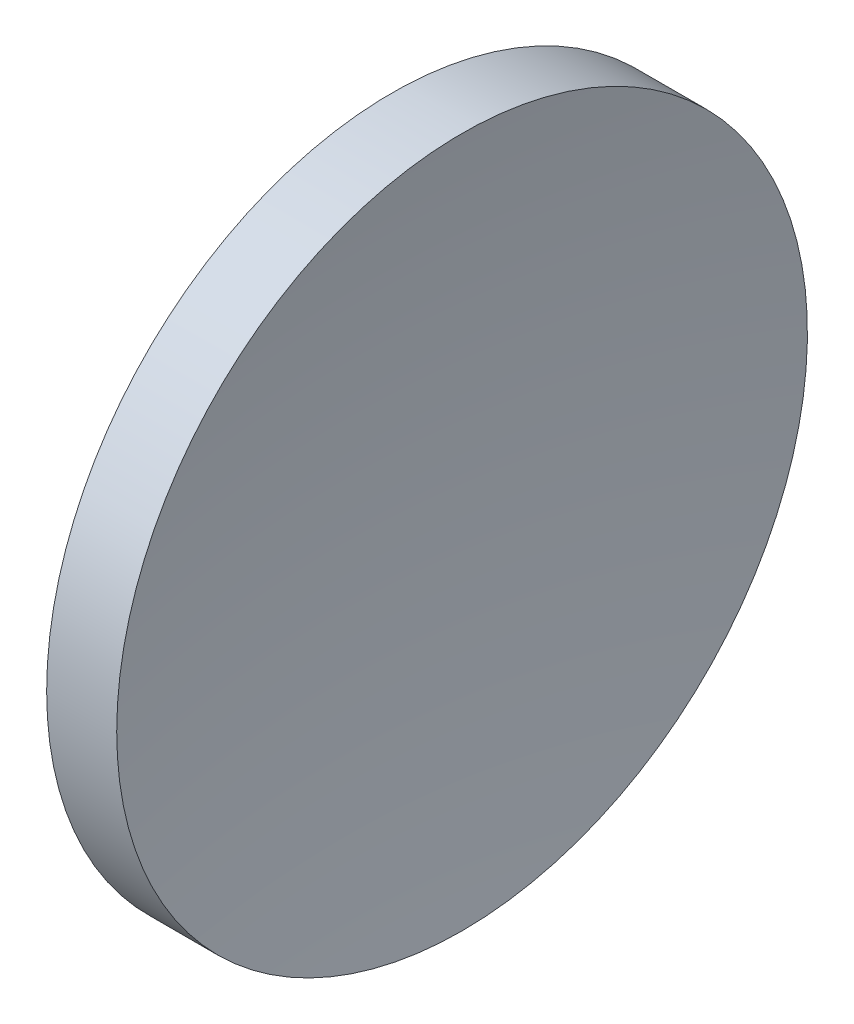
ISO-10303-21;
HEADER;
FILE_DESCRIPTION(('STEP AP214'),'2;1');
FILE_NAME('part.step','',(''),(''),'','','');
FILE_SCHEMA(('AUTOMOTIVE_DESIGN { 1 0 10303 214 1 1 1 1 }'));
ENDSEC;
DATA;
#1=APPLICATION_CONTEXT('core data for automotive mechanical design processes');
#2=APPLICATION_PROTOCOL_DEFINITION('international standard','automotive_design',2000,#1);
#3=PRODUCT_CONTEXT('',#1,'mechanical');
#4=PRODUCT('Part','Part','',(#3));
#5=PRODUCT_RELATED_PRODUCT_CATEGORY('part','',(#4));
#6=PRODUCT_DEFINITION_FORMATION('','',#4);
#7=PRODUCT_DEFINITION_CONTEXT('part definition',#1,'design');
#8=PRODUCT_DEFINITION('design','',#6,#7);
#9=PRODUCT_DEFINITION_SHAPE('','',#8);
#10=(LENGTH_UNIT() NAMED_UNIT(*) SI_UNIT(.MILLI.,.METRE.));
#11=(NAMED_UNIT(*) PLANE_ANGLE_UNIT() SI_UNIT($,.RADIAN.));
#12=(NAMED_UNIT(*) SI_UNIT($,.STERADIAN.) SOLID_ANGLE_UNIT());
#13=UNCERTAINTY_MEASURE_WITH_UNIT(LENGTH_MEASURE(1.E-05),#10,'distance_accuracy_value','');
#14=(GEOMETRIC_REPRESENTATION_CONTEXT(3) GLOBAL_UNCERTAINTY_ASSIGNED_CONTEXT((#13)) GLOBAL_UNIT_ASSIGNED_CONTEXT((#10,
#11,#12)) REPRESENTATION_CONTEXT('',''));
#15=CARTESIAN_POINT('',(0.,0.,0.));
#16=DIRECTION('',(0.,0.,1.));
#17=DIRECTION('',(1.,0.,0.));
#18=AXIS2_PLACEMENT_3D('',#15,#16,#17);
#19=CARTESIAN_POINT('',(245.65193167416,65.1556304570152,0.));
#20=DIRECTION('',(-1.,0.,0.));
#21=DIRECTION('',(0.,-1.,0.));
#22=AXIS2_PLACEMENT_3D('',#19,#20,#21);
#23=SPHERICAL_SURFACE('',#22,129.24);
#24=CARTESIAN_POINT('',(117.968817677046,65.1556304570152,0.));
#25=DIRECTION('',(-1.,0.,0.));
#26=DIRECTION('',(0.,0.,1.));
#27=AXIS2_PLACEMENT_3D('',#24,#25,#26);
#28=CIRCLE('',#27,20.);
#29=CARTESIAN_POINT('',(117.968817677046,65.1556304570152,20.));
#30=VERTEX_POINT('',#29);
#31=EDGE_CURVE('E10',#30,#30,#28,.T.);
#32=ORIENTED_EDGE('',*,*,#31,.F.);
#33=EDGE_LOOP('',(#32));
#34=FACE_BOUND('',#33,.T.);
#35=ADVANCED_FACE('F35',(#34),#23,.F.);
#36=CARTESIAN_POINT('',(105.62183712383,65.1556304570152,0.));
#37=DIRECTION('',(-1.,0.,0.));
#38=DIRECTION('',(0.,0.,1.));
#39=AXIS2_PLACEMENT_3D('',#36,#37,#38);
#40=CYLINDRICAL_SURFACE('',#39,20.);
#41=CARTESIAN_POINT('',(113.91193167416,65.1556304570152,0.));
#42=DIRECTION('',(-1.,0.,0.));
#43=DIRECTION('',(0.,0.,1.));
#44=AXIS2_PLACEMENT_3D('',#41,#42,#43);
#45=CIRCLE('',#44,20.);
#46=CARTESIAN_POINT('',(113.91193167416,65.1556304570152,20.));
#47=VERTEX_POINT('',#46);
#48=EDGE_CURVE('E41',#47,#47,#45,.T.);
#49=ORIENTED_EDGE('',*,*,#48,.F.);
#50=EDGE_LOOP('',(#49));
#51=FACE_BOUND('',#50,.T.);
#52=ORIENTED_EDGE('',*,*,#31,.T.);
#53=EDGE_LOOP('',(#52));
#54=FACE_BOUND('',#53,.T.);
#55=ADVANCED_FACE('F49',(#51,#54),#40,.T.);
#56=CARTESIAN_POINT('',(113.91193167416,65.1556304570152,0.));
#57=DIRECTION('',(1.,0.,0.));
#58=DIRECTION('',(0.,0.,-1.));
#59=AXIS2_PLACEMENT_3D('',#56,#57,#58);
#60=PLANE('',#59);
#61=ORIENTED_EDGE('',*,*,#48,.T.);
#62=EDGE_LOOP('',(#61));
#63=FACE_BOUND('',#62,.T.);
#64=ADVANCED_FACE('F47',(#63),#60,.F.);
#65=CLOSED_SHELL('',(#35,#55,#64));
#66=MANIFOLD_SOLID_BREP('B2',#65);
#67=ADVANCED_BREP_SHAPE_REPRESENTATION('',(#18,#66),#14);
#68=SHAPE_DEFINITION_REPRESENTATION(#9,#67);
ENDSEC;
END-ISO-10303-21;
